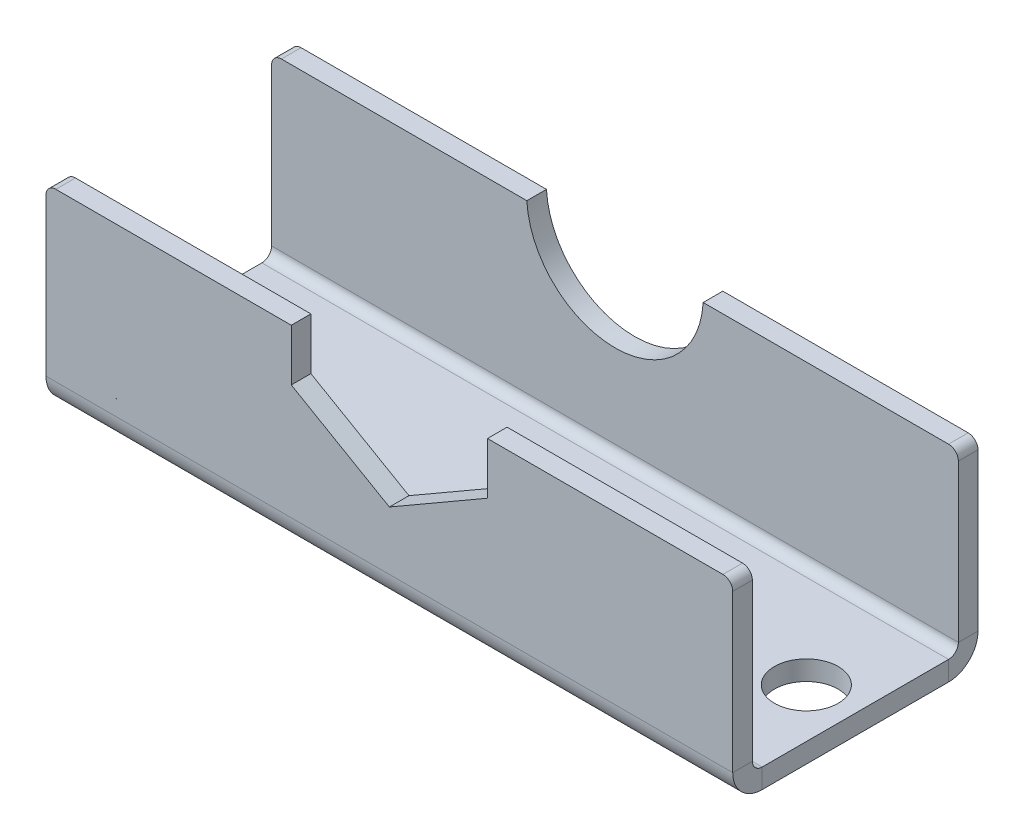
ISO-10303-21;
HEADER;
FILE_DESCRIPTION(('STEP AP214'),'2;1');
FILE_NAME('part.step','',(''),(''),'','','');
FILE_SCHEMA(('AUTOMOTIVE_DESIGN { 1 0 10303 214 1 1 1 1 }'));
ENDSEC;
DATA;
#1=APPLICATION_CONTEXT('core data for automotive mechanical design processes');
#2=APPLICATION_PROTOCOL_DEFINITION('international standard','automotive_design',2000,#1);
#3=PRODUCT_CONTEXT('',#1,'mechanical');
#4=PRODUCT('Part','Part','',(#3));
#5=PRODUCT_RELATED_PRODUCT_CATEGORY('part','',(#4));
#6=PRODUCT_DEFINITION_FORMATION('','',#4);
#7=PRODUCT_DEFINITION_CONTEXT('part definition',#1,'design');
#8=PRODUCT_DEFINITION('design','',#6,#7);
#9=PRODUCT_DEFINITION_SHAPE('','',#8);
#10=(LENGTH_UNIT() NAMED_UNIT(*) SI_UNIT(.MILLI.,.METRE.));
#11=(NAMED_UNIT(*) PLANE_ANGLE_UNIT() SI_UNIT($,.RADIAN.));
#12=(NAMED_UNIT(*) SI_UNIT($,.STERADIAN.) SOLID_ANGLE_UNIT());
#13=UNCERTAINTY_MEASURE_WITH_UNIT(LENGTH_MEASURE(1.E-05),#10,'distance_accuracy_value','');
#14=(GEOMETRIC_REPRESENTATION_CONTEXT(3) GLOBAL_UNCERTAINTY_ASSIGNED_CONTEXT((#13)) GLOBAL_UNIT_ASSIGNED_CONTEXT((#10,
#11,#12)) REPRESENTATION_CONTEXT('',''));
#15=CARTESIAN_POINT('',(0.,0.,0.));
#16=DIRECTION('',(0.,0.,1.));
#17=DIRECTION('',(1.,0.,0.));
#18=AXIS2_PLACEMENT_3D('',#15,#16,#17);
#19=CARTESIAN_POINT('',(70.,0.,-12.5));
#20=DIRECTION('',(0.,0.,-1.));
#21=DIRECTION('',(-1.,0.,0.));
#22=AXIS2_PLACEMENT_3D('',#19,#20,#21);
#23=PLANE('',#22);
#24=DIRECTION('',(0.,-1.,0.));
#25=VECTOR('',#24,1.);
#26=CARTESIAN_POINT('',(0.,0.,-12.5));
#27=LINE('',#26,#25);
#28=CARTESIAN_POINT('',(0.,19.,-12.5));
#29=VERTEX_POINT('',#28);
#30=CARTESIAN_POINT('',(0.,3.,-12.5));
#31=VERTEX_POINT('',#30);
#32=EDGE_CURVE('E380',#29,#31,#27,.T.);
#33=ORIENTED_EDGE('',*,*,#32,.F.);
#34=CARTESIAN_POINT('',(1.,19.,-12.5));
#35=DIRECTION('',(0.,0.,-1.));
#36=DIRECTION('',(-1.,0.,0.));
#37=AXIS2_PLACEMENT_3D('',#34,#35,#36);
#38=CIRCLE('',#37,1.);
#39=CARTESIAN_POINT('',(1.,20.,-12.5));
#40=VERTEX_POINT('',#39);
#41=EDGE_CURVE('E219',#29,#40,#38,.T.);
#42=ORIENTED_EDGE('',*,*,#41,.T.);
#43=DIRECTION('',(-1.,0.,0.));
#44=VECTOR('',#43,1.);
#45=CARTESIAN_POINT('',(70.,20.,-12.5));
#46=LINE('',#45,#44);
#47=CARTESIAN_POINT('',(26.0138996221943,20.,-12.5));
#48=VERTEX_POINT('',#47);
#49=EDGE_CURVE('E212',#48,#40,#46,.T.);
#50=ORIENTED_EDGE('',*,*,#49,.F.);
#51=CARTESIAN_POINT('',(35.,20.5,-12.5));
#52=DIRECTION('',(0.,0.,1.));
#53=DIRECTION('',(1.,0.,0.));
#54=AXIS2_PLACEMENT_3D('',#51,#52,#53);
#55=CIRCLE('',#54,9.);
#56=CARTESIAN_POINT('',(43.9861003778057,20.,-12.5));
#57=VERTEX_POINT('',#56);
#58=EDGE_CURVE('E195',#48,#57,#55,.T.);
#59=ORIENTED_EDGE('',*,*,#58,.T.);
#60=CARTESIAN_POINT('',(69.,20.,-12.5));
#61=VERTEX_POINT('',#60);
#62=EDGE_CURVE('E220',#61,#57,#46,.T.);
#63=ORIENTED_EDGE('',*,*,#62,.F.);
#64=CARTESIAN_POINT('',(69.,19.,-12.5));
#65=DIRECTION('',(0.,0.,-1.));
#66=DIRECTION('',(-1.,0.,0.));
#67=AXIS2_PLACEMENT_3D('',#64,#65,#66);
#68=CIRCLE('',#67,1.);
#69=CARTESIAN_POINT('',(70.,19.,-12.5));
#70=VERTEX_POINT('',#69);
#71=EDGE_CURVE('E265',#61,#70,#68,.T.);
#72=ORIENTED_EDGE('',*,*,#71,.T.);
#73=DIRECTION('',(0.,-1.,0.));
#74=VECTOR('',#73,1.);
#75=CARTESIAN_POINT('',(70.,0.,-12.5));
#76=LINE('',#75,#74);
#77=CARTESIAN_POINT('',(70.,3.,-12.5));
#78=VERTEX_POINT('',#77);
#79=EDGE_CURVE('E353',#70,#78,#76,.T.);
#80=ORIENTED_EDGE('',*,*,#79,.T.);
#81=DIRECTION('',(-1.,0.,0.));
#82=VECTOR('',#81,1.);
#83=CARTESIAN_POINT('',(70.,3.,-12.5));
#84=LINE('',#83,#82);
#85=EDGE_CURVE('E223',#78,#31,#84,.T.);
#86=ORIENTED_EDGE('',*,*,#85,.T.);
#87=EDGE_LOOP('',(#33,#42,#50,#59,#63,#72,#80,#86));
#88=FACE_BOUND('',#87,.T.);
#89=ADVANCED_FACE('F40',(#88),#23,.T.);
#90=CARTESIAN_POINT('',(70.,20.,-10.5));
#91=DIRECTION('',(0.,1.,0.));
#92=DIRECTION('',(0.,0.,1.));
#93=AXIS2_PLACEMENT_3D('',#90,#91,#92);
#94=PLANE('',#93);
#95=DIRECTION('',(-1.,0.,0.));
#96=VECTOR('',#95,1.);
#97=CARTESIAN_POINT('',(70.,20.,-10.5));
#98=LINE('',#97,#96);
#99=CARTESIAN_POINT('',(69.,20.,-10.5));
#100=VERTEX_POINT('',#99);
#101=CARTESIAN_POINT('',(43.9861003778057,20.,-10.5));
#102=VERTEX_POINT('',#101);
#103=EDGE_CURVE('E221',#100,#102,#98,.T.);
#104=ORIENTED_EDGE('',*,*,#103,.F.);
#105=DIRECTION('',(0.,0.,-1.));
#106=VECTOR('',#105,1.);
#107=CARTESIAN_POINT('',(69.,20.,-10.5));
#108=LINE('',#107,#106);
#109=EDGE_CURVE('E286',#100,#61,#108,.T.);
#110=ORIENTED_EDGE('',*,*,#109,.T.);
#111=ORIENTED_EDGE('',*,*,#62,.T.);
#112=DIRECTION('',(0.,0.,1.));
#113=VECTOR('',#112,1.);
#114=CARTESIAN_POINT('',(43.9861003778057,20.,-10.5));
#115=LINE('',#114,#113);
#116=EDGE_CURVE('E202',#102,#57,#115,.F.);
#117=ORIENTED_EDGE('',*,*,#116,.F.);
#118=EDGE_LOOP('',(#104,#110,#111,#117));
#119=FACE_BOUND('',#118,.T.);
#120=ADVANCED_FACE('F520',(#119),#94,.T.);
#121=ORIENTED_EDGE('',*,*,#49,.T.);
#122=DIRECTION('',(0.,0.,-1.));
#123=VECTOR('',#122,1.);
#124=CARTESIAN_POINT('',(1.,20.,-10.5));
#125=LINE('',#124,#123);
#126=CARTESIAN_POINT('',(1.,20.,-10.5));
#127=VERTEX_POINT('',#126);
#128=EDGE_CURVE('E268',#40,#127,#125,.F.);
#129=ORIENTED_EDGE('',*,*,#128,.T.);
#130=CARTESIAN_POINT('',(26.0138996221943,20.,-10.5));
#131=VERTEX_POINT('',#130);
#132=EDGE_CURVE('E215',#131,#127,#98,.T.);
#133=ORIENTED_EDGE('',*,*,#132,.F.);
#134=DIRECTION('',(0.,0.,1.));
#135=VECTOR('',#134,1.);
#136=CARTESIAN_POINT('',(26.0138996221943,20.,-10.5));
#137=LINE('',#136,#135);
#138=EDGE_CURVE('E199',#131,#48,#137,.F.);
#139=ORIENTED_EDGE('',*,*,#138,.T.);
#140=EDGE_LOOP('',(#121,#129,#133,#139));
#141=FACE_BOUND('',#140,.T.);
#142=ADVANCED_FACE('F211',(#141),#94,.T.);
#143=CARTESIAN_POINT('',(70.,0.,-10.5));
#144=DIRECTION('',(0.,0.,-1.));
#145=DIRECTION('',(-1.,0.,0.));
#146=AXIS2_PLACEMENT_3D('',#143,#144,#145);
#147=PLANE('',#146);
#148=ORIENTED_EDGE('',*,*,#132,.T.);
#149=CARTESIAN_POINT('',(1.,19.,-10.5));
#150=DIRECTION('',(0.,0.,-1.));
#151=DIRECTION('',(-1.,0.,0.));
#152=AXIS2_PLACEMENT_3D('',#149,#150,#151);
#153=CIRCLE('',#152,1.);
#154=CARTESIAN_POINT('',(0.,19.,-10.5));
#155=VERTEX_POINT('',#154);
#156=EDGE_CURVE('E272',#127,#155,#153,.F.);
#157=ORIENTED_EDGE('',*,*,#156,.T.);
#158=DIRECTION('',(0.,1.,0.));
#159=VECTOR('',#158,1.);
#160=CARTESIAN_POINT('',(0.,0.,-10.5));
#161=LINE('',#160,#159);
#162=CARTESIAN_POINT('',(0.,3.,-10.5));
#163=VERTEX_POINT('',#162);
#164=EDGE_CURVE('E382',#155,#163,#161,.F.);
#165=ORIENTED_EDGE('',*,*,#164,.T.);
#166=DIRECTION('',(-1.,0.,0.));
#167=VECTOR('',#166,1.);
#168=CARTESIAN_POINT('',(70.,3.,-10.5));
#169=LINE('',#168,#167);
#170=CARTESIAN_POINT('',(70.,3.,-10.5));
#171=VERTEX_POINT('',#170);
#172=EDGE_CURVE('E399',#171,#163,#169,.T.);
#173=ORIENTED_EDGE('',*,*,#172,.F.);
#174=DIRECTION('',(0.,1.,0.));
#175=VECTOR('',#174,1.);
#176=CARTESIAN_POINT('',(70.,0.,-10.5));
#177=LINE('',#176,#175);
#178=CARTESIAN_POINT('',(70.,19.,-10.5));
#179=VERTEX_POINT('',#178);
#180=EDGE_CURVE('E355',#179,#171,#177,.F.);
#181=ORIENTED_EDGE('',*,*,#180,.F.);
#182=CARTESIAN_POINT('',(69.,19.,-10.5));
#183=DIRECTION('',(0.,0.,-1.));
#184=DIRECTION('',(-1.,0.,0.));
#185=AXIS2_PLACEMENT_3D('',#182,#183,#184);
#186=CIRCLE('',#185,1.);
#187=EDGE_CURVE('E270',#179,#100,#186,.F.);
#188=ORIENTED_EDGE('',*,*,#187,.T.);
#189=ORIENTED_EDGE('',*,*,#103,.T.);
#190=CARTESIAN_POINT('',(35.,20.5,-10.5));
#191=DIRECTION('',(0.,0.,1.));
#192=DIRECTION('',(1.,0.,0.));
#193=AXIS2_PLACEMENT_3D('',#190,#191,#192);
#194=CIRCLE('',#193,9.);
#195=EDGE_CURVE('E206',#131,#102,#194,.T.);
#196=ORIENTED_EDGE('',*,*,#195,.F.);
#197=EDGE_LOOP('',(#148,#157,#165,#173,#181,#188,#189,#196));
#198=FACE_BOUND('',#197,.T.);
#199=ADVANCED_FACE('F407',(#198),#147,.F.);
#200=CARTESIAN_POINT('',(70.,20.,12.5));
#201=DIRECTION('',(0.,1.,0.));
#202=DIRECTION('',(0.,0.,1.));
#203=AXIS2_PLACEMENT_3D('',#200,#201,#202);
#204=PLANE('',#203);
#205=DIRECTION('',(-1.,0.,0.));
#206=VECTOR('',#205,1.);
#207=CARTESIAN_POINT('',(70.,20.,12.5));
#208=LINE('',#207,#206);
#209=CARTESIAN_POINT('',(69.,20.,12.5));
#210=VERTEX_POINT('',#209);
#211=CARTESIAN_POINT('',(45.,20.,12.5));
#212=VERTEX_POINT('',#211);
#213=EDGE_CURVE('E239',#210,#212,#208,.T.);
#214=ORIENTED_EDGE('',*,*,#213,.F.);
#215=DIRECTION('',(0.,0.,-1.));
#216=VECTOR('',#215,1.);
#217=CARTESIAN_POINT('',(69.,20.,12.5));
#218=LINE('',#217,#216);
#219=CARTESIAN_POINT('',(69.,20.,10.5));
#220=VERTEX_POINT('',#219);
#221=EDGE_CURVE('E48',#210,#220,#218,.T.);
#222=ORIENTED_EDGE('',*,*,#221,.T.);
#223=DIRECTION('',(-1.,0.,0.));
#224=VECTOR('',#223,1.);
#225=CARTESIAN_POINT('',(70.,20.,10.5));
#226=LINE('',#225,#224);
#227=CARTESIAN_POINT('',(45.,20.,10.5));
#228=VERTEX_POINT('',#227);
#229=EDGE_CURVE('E242',#220,#228,#226,.T.);
#230=ORIENTED_EDGE('',*,*,#229,.T.);
#231=DIRECTION('',(0.,0.,1.));
#232=VECTOR('',#231,1.);
#233=CARTESIAN_POINT('',(45.,20.,-12.501));
#234=LINE('',#233,#232);
#235=EDGE_CURVE('E216',#228,#212,#234,.T.);
#236=ORIENTED_EDGE('',*,*,#235,.T.);
#237=EDGE_LOOP('',(#214,#222,#230,#236));
#238=FACE_BOUND('',#237,.T.);
#239=ADVANCED_FACE('F294',(#238),#204,.T.);
#240=CARTESIAN_POINT('',(70.,0.,-9.5));
#241=DIRECTION('',(1.,0.,0.));
#242=DIRECTION('',(0.,0.,-1.));
#243=AXIS2_PLACEMENT_3D('',#240,#241,#242);
#244=PLANE('',#243);
#245=DIRECTION('',(0.,1.,0.));
#246=VECTOR('',#245,1.);
#247=CARTESIAN_POINT('',(70.,0.,-9.5));
#248=LINE('',#247,#246);
#249=CARTESIAN_POINT('',(70.,0.,-9.5));
#250=VERTEX_POINT('',#249);
#251=CARTESIAN_POINT('',(70.,2.,-9.5));
#252=VERTEX_POINT('',#251);
#253=EDGE_CURVE('E260',#250,#252,#248,.T.);
#254=ORIENTED_EDGE('',*,*,#253,.F.);
#255=CARTESIAN_POINT('',(70.,3.,-9.5));
#256=DIRECTION('',(1.,0.,0.));
#257=DIRECTION('',(0.,0.,-1.));
#258=AXIS2_PLACEMENT_3D('',#255,#256,#257);
#259=CIRCLE('',#258,3.);
#260=EDGE_CURVE('E350',#78,#250,#259,.F.);
#261=ORIENTED_EDGE('',*,*,#260,.F.);
#262=DIRECTION('',(0.,0.,-1.));
#263=VECTOR('',#262,1.);
#264=CARTESIAN_POINT('',(70.,3.,-10.5));
#265=LINE('',#264,#263);
#266=EDGE_CURVE('E257',#171,#78,#265,.T.);
#267=ORIENTED_EDGE('',*,*,#266,.F.);
#268=CARTESIAN_POINT('',(70.,3.,-9.5));
#269=DIRECTION('',(1.,0.,0.));
#270=DIRECTION('',(0.,0.,-1.));
#271=AXIS2_PLACEMENT_3D('',#268,#269,#270);
#272=CIRCLE('',#271,1.);
#273=EDGE_CURVE('E357',#171,#252,#272,.F.);
#274=ORIENTED_EDGE('',*,*,#273,.T.);
#275=EDGE_LOOP('',(#254,#261,#267,#274));
#276=FACE_BOUND('',#275,.T.);
#277=ADVANCED_FACE('F557',(#276),#244,.T.);
#278=CARTESIAN_POINT('',(70.,3.,-10.5));
#279=DIRECTION('',(1.,0.,0.));
#280=DIRECTION('',(0.,0.,-1.));
#281=AXIS2_PLACEMENT_3D('',#278,#279,#280);
#282=PLANE('',#281);
#283=DIRECTION('',(0.,0.,1.));
#284=VECTOR('',#283,1.);
#285=CARTESIAN_POINT('',(70.,0.,12.5));
#286=LINE('',#285,#284);
#287=CARTESIAN_POINT('',(70.,0.,9.5));
#288=VERTEX_POINT('',#287);
#289=EDGE_CURVE('E347',#250,#288,#286,.T.);
#290=ORIENTED_EDGE('',*,*,#289,.F.);
#291=ORIENTED_EDGE('',*,*,#253,.T.);
#292=DIRECTION('',(0.,0.,1.));
#293=VECTOR('',#292,1.);
#294=CARTESIAN_POINT('',(70.,2.,12.5));
#295=LINE('',#294,#293);
#296=CARTESIAN_POINT('',(70.,2.,9.5));
#297=VERTEX_POINT('',#296);
#298=EDGE_CURVE('E360',#252,#297,#295,.T.);
#299=ORIENTED_EDGE('',*,*,#298,.T.);
#300=DIRECTION('',(0.,-1.,0.));
#301=VECTOR('',#300,1.);
#302=CARTESIAN_POINT('',(70.,2.,9.5));
#303=LINE('',#302,#301);
#304=EDGE_CURVE('E248',#297,#288,#303,.T.);
#305=ORIENTED_EDGE('',*,*,#304,.T.);
#306=EDGE_LOOP('',(#290,#291,#299,#305));
#307=FACE_BOUND('',#306,.T.);
#308=ADVANCED_FACE('F554',(#307),#282,.T.);
#309=CARTESIAN_POINT('',(0.,3.,-12.5));
#310=DIRECTION('',(-1.,0.,0.));
#311=DIRECTION('',(0.,0.,1.));
#312=AXIS2_PLACEMENT_3D('',#309,#310,#311);
#313=PLANE('',#312);
#314=DIRECTION('',(0.,0.,1.));
#315=VECTOR('',#314,1.);
#316=CARTESIAN_POINT('',(0.,3.,-12.5));
#317=LINE('',#316,#315);
#318=EDGE_CURVE('E254',#31,#163,#317,.T.);
#319=ORIENTED_EDGE('',*,*,#318,.F.);
#320=CARTESIAN_POINT('',(0.,3.,-9.5));
#321=DIRECTION('',(1.,0.,0.));
#322=DIRECTION('',(0.,0.,-1.));
#323=AXIS2_PLACEMENT_3D('',#320,#321,#322);
#324=CIRCLE('',#323,3.);
#325=CARTESIAN_POINT('',(0.,0.,-9.5));
#326=VERTEX_POINT('',#325);
#327=EDGE_CURVE('E377',#31,#326,#324,.F.);
#328=ORIENTED_EDGE('',*,*,#327,.T.);
#329=DIRECTION('',(0.,-1.,0.));
#330=VECTOR('',#329,1.);
#331=CARTESIAN_POINT('',(0.,2.,-9.5));
#332=LINE('',#331,#330);
#333=CARTESIAN_POINT('',(0.,2.,-9.5));
#334=VERTEX_POINT('',#333);
#335=EDGE_CURVE('E252',#334,#326,#332,.T.);
#336=ORIENTED_EDGE('',*,*,#335,.F.);
#337=CARTESIAN_POINT('',(0.,3.,-9.5));
#338=DIRECTION('',(1.,0.,0.));
#339=DIRECTION('',(0.,0.,-1.));
#340=AXIS2_PLACEMENT_3D('',#337,#338,#339);
#341=CIRCLE('',#340,1.);
#342=EDGE_CURVE('E384',#163,#334,#341,.F.);
#343=ORIENTED_EDGE('',*,*,#342,.F.);
#344=EDGE_LOOP('',(#319,#328,#336,#343));
#345=FACE_BOUND('',#344,.T.);
#346=ADVANCED_FACE('F424',(#345),#313,.T.);
#347=CARTESIAN_POINT('',(0.,2.,-9.5));
#348=DIRECTION('',(-1.,0.,0.));
#349=DIRECTION('',(0.,0.,1.));
#350=AXIS2_PLACEMENT_3D('',#347,#348,#349);
#351=PLANE('',#350);
#352=ORIENTED_EDGE('',*,*,#164,.F.);
#353=DIRECTION('',(0.,0.,-1.));
#354=VECTOR('',#353,1.);
#355=CARTESIAN_POINT('',(0.,19.,-9.5));
#356=LINE('',#355,#354);
#357=EDGE_CURVE('E262',#155,#29,#356,.T.);
#358=ORIENTED_EDGE('',*,*,#357,.T.);
#359=ORIENTED_EDGE('',*,*,#32,.T.);
#360=ORIENTED_EDGE('',*,*,#318,.T.);
#361=EDGE_LOOP('',(#352,#358,#359,#360));
#362=FACE_BOUND('',#361,.T.);
#363=ADVANCED_FACE('F413',(#362),#351,.T.);
#364=CARTESIAN_POINT('',(70.,3.,12.5));
#365=DIRECTION('',(1.,0.,0.));
#366=DIRECTION('',(0.,0.,-1.));
#367=AXIS2_PLACEMENT_3D('',#364,#365,#366);
#368=PLANE('',#367);
#369=DIRECTION('',(0.,0.,-1.));
#370=VECTOR('',#369,1.);
#371=CARTESIAN_POINT('',(70.,3.,12.5));
#372=LINE('',#371,#370);
#373=CARTESIAN_POINT('',(70.,3.,12.5));
#374=VERTEX_POINT('',#373);
#375=CARTESIAN_POINT('',(70.,3.,10.5));
#376=VERTEX_POINT('',#375);
#377=EDGE_CURVE('E250',#374,#376,#372,.T.);
#378=ORIENTED_EDGE('',*,*,#377,.F.);
#379=CARTESIAN_POINT('',(70.,3.,9.5));
#380=DIRECTION('',(1.,0.,0.));
#381=DIRECTION('',(0.,0.,-1.));
#382=AXIS2_PLACEMENT_3D('',#379,#380,#381);
#383=CIRCLE('',#382,3.);
#384=EDGE_CURVE('E344',#288,#374,#383,.F.);
#385=ORIENTED_EDGE('',*,*,#384,.F.);
#386=ORIENTED_EDGE('',*,*,#304,.F.);
#387=CARTESIAN_POINT('',(70.,3.,9.5));
#388=DIRECTION('',(1.,0.,0.));
#389=DIRECTION('',(0.,0.,-1.));
#390=AXIS2_PLACEMENT_3D('',#387,#388,#389);
#391=CIRCLE('',#390,1.);
#392=EDGE_CURVE('E363',#297,#376,#391,.F.);
#393=ORIENTED_EDGE('',*,*,#392,.T.);
#394=EDGE_LOOP('',(#378,#385,#386,#393));
#395=FACE_BOUND('',#394,.T.);
#396=ADVANCED_FACE('F546',(#395),#368,.T.);
#397=CARTESIAN_POINT('',(70.,2.,9.5));
#398=DIRECTION('',(1.,0.,0.));
#399=DIRECTION('',(0.,0.,-1.));
#400=AXIS2_PLACEMENT_3D('',#397,#398,#399);
#401=PLANE('',#400);
#402=DIRECTION('',(0.,1.,0.));
#403=VECTOR('',#402,1.);
#404=CARTESIAN_POINT('',(70.,0.,10.5));
#405=LINE('',#404,#403);
#406=CARTESIAN_POINT('',(70.,19.,10.5));
#407=VERTEX_POINT('',#406);
#408=EDGE_CURVE('E339',#376,#407,#405,.T.);
#409=ORIENTED_EDGE('',*,*,#408,.T.);
#410=DIRECTION('',(0.,0.,-1.));
#411=VECTOR('',#410,1.);
#412=CARTESIAN_POINT('',(70.,19.,9.5));
#413=LINE('',#412,#411);
#414=CARTESIAN_POINT('',(70.,19.,12.5));
#415=VERTEX_POINT('',#414);
#416=EDGE_CURVE('E11',#407,#415,#413,.F.);
#417=ORIENTED_EDGE('',*,*,#416,.T.);
#418=DIRECTION('',(0.,1.,0.));
#419=VECTOR('',#418,1.);
#420=CARTESIAN_POINT('',(70.,0.,12.5));
#421=LINE('',#420,#419);
#422=EDGE_CURVE('E341',#374,#415,#421,.T.);
#423=ORIENTED_EDGE('',*,*,#422,.F.);
#424=ORIENTED_EDGE('',*,*,#377,.T.);
#425=EDGE_LOOP('',(#409,#417,#423,#424));
#426=FACE_BOUND('',#425,.T.);
#427=ADVANCED_FACE('F543',(#426),#401,.T.);
#428=CARTESIAN_POINT('',(0.,0.,9.5));
#429=DIRECTION('',(-1.,0.,0.));
#430=DIRECTION('',(0.,0.,1.));
#431=AXIS2_PLACEMENT_3D('',#428,#429,#430);
#432=PLANE('',#431);
#433=DIRECTION('',(0.,1.,0.));
#434=VECTOR('',#433,1.);
#435=CARTESIAN_POINT('',(0.,0.,9.5));
#436=LINE('',#435,#434);
#437=CARTESIAN_POINT('',(0.,0.,9.5));
#438=VERTEX_POINT('',#437);
#439=CARTESIAN_POINT('',(0.,2.,9.5));
#440=VERTEX_POINT('',#439);
#441=EDGE_CURVE('E246',#438,#440,#436,.T.);
#442=ORIENTED_EDGE('',*,*,#441,.F.);
#443=CARTESIAN_POINT('',(0.,3.,9.5));
#444=DIRECTION('',(1.,0.,0.));
#445=DIRECTION('',(0.,0.,-1.));
#446=AXIS2_PLACEMENT_3D('',#443,#444,#445);
#447=CIRCLE('',#446,3.);
#448=CARTESIAN_POINT('',(0.,3.,12.5));
#449=VERTEX_POINT('',#448);
#450=EDGE_CURVE('E371',#438,#449,#447,.F.);
#451=ORIENTED_EDGE('',*,*,#450,.T.);
#452=DIRECTION('',(0.,0.,1.));
#453=VECTOR('',#452,1.);
#454=CARTESIAN_POINT('',(0.,3.,10.5));
#455=LINE('',#454,#453);
#456=CARTESIAN_POINT('',(0.,3.,10.5));
#457=VERTEX_POINT('',#456);
#458=EDGE_CURVE('E244',#457,#449,#455,.T.);
#459=ORIENTED_EDGE('',*,*,#458,.F.);
#460=CARTESIAN_POINT('',(0.,3.,9.5));
#461=DIRECTION('',(1.,0.,0.));
#462=DIRECTION('',(0.,0.,-1.));
#463=AXIS2_PLACEMENT_3D('',#460,#461,#462);
#464=CIRCLE('',#463,1.);
#465=EDGE_CURVE('E342',#440,#457,#464,.F.);
#466=ORIENTED_EDGE('',*,*,#465,.F.);
#467=EDGE_LOOP('',(#442,#451,#459,#466));
#468=FACE_BOUND('',#467,.T.);
#469=ADVANCED_FACE('F436',(#468),#432,.T.);
#470=CARTESIAN_POINT('',(0.,3.,10.5));
#471=DIRECTION('',(-1.,0.,0.));
#472=DIRECTION('',(0.,0.,1.));
#473=AXIS2_PLACEMENT_3D('',#470,#471,#472);
#474=PLANE('',#473);
#475=DIRECTION('',(0.,0.,1.));
#476=VECTOR('',#475,1.);
#477=CARTESIAN_POINT('',(0.,0.,12.5));
#478=LINE('',#477,#476);
#479=EDGE_CURVE('E374',#326,#438,#478,.T.);
#480=ORIENTED_EDGE('',*,*,#479,.T.);
#481=ORIENTED_EDGE('',*,*,#441,.T.);
#482=DIRECTION('',(0.,0.,1.));
#483=VECTOR('',#482,1.);
#484=CARTESIAN_POINT('',(0.,2.,12.5));
#485=LINE('',#484,#483);
#486=EDGE_CURVE('E387',#334,#440,#485,.T.);
#487=ORIENTED_EDGE('',*,*,#486,.F.);
#488=ORIENTED_EDGE('',*,*,#335,.T.);
#489=EDGE_LOOP('',(#480,#481,#487,#488));
#490=FACE_BOUND('',#489,.T.);
#491=ADVANCED_FACE('F433',(#490),#474,.T.);
#492=CARTESIAN_POINT('',(70.,0.,10.5));
#493=DIRECTION('',(0.,0.,1.));
#494=DIRECTION('',(0.,-1.,0.));
#495=AXIS2_PLACEMENT_3D('',#492,#493,#494);
#496=PLANE('',#495);
#497=DIRECTION('',(0.,1.,0.));
#498=VECTOR('',#497,1.);
#499=CARTESIAN_POINT('',(0.,0.,10.5));
#500=LINE('',#499,#498);
#501=CARTESIAN_POINT('',(0.,19.,10.5));
#502=VERTEX_POINT('',#501);
#503=EDGE_CURVE('E338',#457,#502,#500,.T.);
#504=ORIENTED_EDGE('',*,*,#503,.T.);
#505=CARTESIAN_POINT('',(1.,19.,10.5));
#506=DIRECTION('',(0.,0.,1.));
#507=DIRECTION('',(0.,-1.,0.));
#508=AXIS2_PLACEMENT_3D('',#505,#506,#507);
#509=CIRCLE('',#508,1.);
#510=CARTESIAN_POINT('',(1.,20.,10.5));
#511=VERTEX_POINT('',#510);
#512=EDGE_CURVE('E279',#502,#511,#509,.F.);
#513=ORIENTED_EDGE('',*,*,#512,.T.);
#514=CARTESIAN_POINT('',(25.,20.,10.5));
#515=VERTEX_POINT('',#514);
#516=EDGE_CURVE('E241',#515,#511,#226,.T.);
#517=ORIENTED_EDGE('',*,*,#516,.F.);
#518=DIRECTION('',(0.,1.,0.));
#519=VECTOR('',#518,1.);
#520=CARTESIAN_POINT('',(25.,26.2735026918962,10.5));
#521=LINE('',#520,#519);
#522=CARTESIAN_POINT('',(25.,14.7264973081038,10.5));
#523=VERTEX_POINT('',#522);
#524=EDGE_CURVE('E312',#523,#515,#521,.T.);
#525=ORIENTED_EDGE('',*,*,#524,.F.);
#526=DIRECTION('',(-0.866025403784439,0.5,0.));
#527=VECTOR('',#526,1.);
#528=CARTESIAN_POINT('',(25.,14.7264973081037,10.5));
#529=LINE('',#528,#527);
#530=CARTESIAN_POINT('',(35.,8.95299461620749,10.5));
#531=VERTEX_POINT('',#530);
#532=EDGE_CURVE('E309',#531,#523,#529,.T.);
#533=ORIENTED_EDGE('',*,*,#532,.F.);
#534=DIRECTION('',(-0.866025403784438,-0.500000000000001,0.));
#535=VECTOR('',#534,1.);
#536=CARTESIAN_POINT('',(35.,8.95299461620749,10.5));
#537=LINE('',#536,#535);
#538=CARTESIAN_POINT('',(45.,14.7264973081038,10.5));
#539=VERTEX_POINT('',#538);
#540=EDGE_CURVE('E306',#539,#531,#537,.T.);
#541=ORIENTED_EDGE('',*,*,#540,.F.);
#542=DIRECTION('',(0.,-1.,0.));
#543=VECTOR('',#542,1.);
#544=CARTESIAN_POINT('',(45.,14.7264973081037,10.5));
#545=LINE('',#544,#543);
#546=EDGE_CURVE('E304',#228,#539,#545,.T.);
#547=ORIENTED_EDGE('',*,*,#546,.F.);
#548=ORIENTED_EDGE('',*,*,#229,.F.);
#549=CARTESIAN_POINT('',(69.,19.,10.5));
#550=DIRECTION('',(0.,0.,1.));
#551=DIRECTION('',(0.,-1.,0.));
#552=AXIS2_PLACEMENT_3D('',#549,#550,#551);
#553=CIRCLE('',#552,1.);
#554=EDGE_CURVE('E277',#220,#407,#553,.F.);
#555=ORIENTED_EDGE('',*,*,#554,.T.);
#556=ORIENTED_EDGE('',*,*,#408,.F.);
#557=DIRECTION('',(-1.,0.,0.));
#558=VECTOR('',#557,1.);
#559=CARTESIAN_POINT('',(70.,3.,10.5));
#560=LINE('',#559,#558);
#561=EDGE_CURVE('E366',#376,#457,#560,.T.);
#562=ORIENTED_EDGE('',*,*,#561,.T.);
#563=EDGE_LOOP('',(#504,#513,#517,#525,#533,#541,#547,#548,#555,#556,#562));
#564=FACE_BOUND('',#563,.T.);
#565=ADVANCED_FACE('F301',(#564),#496,.F.);
#566=ORIENTED_EDGE('',*,*,#516,.T.);
#567=DIRECTION('',(0.,0.,-1.));
#568=VECTOR('',#567,1.);
#569=CARTESIAN_POINT('',(1.,20.,12.5));
#570=LINE('',#569,#568);
#571=CARTESIAN_POINT('',(1.,20.,12.5));
#572=VERTEX_POINT('',#571);
#573=EDGE_CURVE('E281',#511,#572,#570,.F.);
#574=ORIENTED_EDGE('',*,*,#573,.T.);
#575=CARTESIAN_POINT('',(25.,20.,12.5));
#576=VERTEX_POINT('',#575);
#577=EDGE_CURVE('E238',#576,#572,#208,.T.);
#578=ORIENTED_EDGE('',*,*,#577,.F.);
#579=DIRECTION('',(0.,0.,-1.));
#580=VECTOR('',#579,1.);
#581=CARTESIAN_POINT('',(25.,20.,-12.501));
#582=LINE('',#581,#580);
#583=EDGE_CURVE('E310',#576,#515,#582,.T.);
#584=ORIENTED_EDGE('',*,*,#583,.T.);
#585=EDGE_LOOP('',(#566,#574,#578,#584));
#586=FACE_BOUND('',#585,.T.);
#587=ADVANCED_FACE('F461',(#586),#204,.T.);
#588=CARTESIAN_POINT('',(70.,0.,12.5));
#589=DIRECTION('',(0.,0.,1.));
#590=DIRECTION('',(0.,-1.,0.));
#591=AXIS2_PLACEMENT_3D('',#588,#589,#590);
#592=PLANE('',#591);
#593=ORIENTED_EDGE('',*,*,#577,.T.);
#594=CARTESIAN_POINT('',(1.,19.,12.5));
#595=DIRECTION('',(0.,0.,1.));
#596=DIRECTION('',(0.,-1.,0.));
#597=AXIS2_PLACEMENT_3D('',#594,#595,#596);
#598=CIRCLE('',#597,1.);
#599=CARTESIAN_POINT('',(0.,19.,12.5));
#600=VERTEX_POINT('',#599);
#601=EDGE_CURVE('E284',#572,#600,#598,.T.);
#602=ORIENTED_EDGE('',*,*,#601,.T.);
#603=DIRECTION('',(0.,1.,0.));
#604=VECTOR('',#603,1.);
#605=CARTESIAN_POINT('',(0.,0.,12.5));
#606=LINE('',#605,#604);
#607=EDGE_CURVE('E368',#449,#600,#606,.T.);
#608=ORIENTED_EDGE('',*,*,#607,.F.);
#609=DIRECTION('',(-1.,0.,0.));
#610=VECTOR('',#609,1.);
#611=CARTESIAN_POINT('',(70.,3.,12.5));
#612=LINE('',#611,#610);
#613=EDGE_CURVE('E235',#374,#449,#612,.T.);
#614=ORIENTED_EDGE('',*,*,#613,.F.);
#615=ORIENTED_EDGE('',*,*,#422,.T.);
#616=CARTESIAN_POINT('',(69.,19.,12.5));
#617=DIRECTION('',(0.,0.,1.));
#618=DIRECTION('',(0.,-1.,0.));
#619=AXIS2_PLACEMENT_3D('',#616,#617,#618);
#620=CIRCLE('',#619,1.);
#621=EDGE_CURVE('E55',#415,#210,#620,.T.);
#622=ORIENTED_EDGE('',*,*,#621,.T.);
#623=ORIENTED_EDGE('',*,*,#213,.T.);
#624=DIRECTION('',(0.,1.,0.));
#625=VECTOR('',#624,1.);
#626=CARTESIAN_POINT('',(45.,14.7264973081038,12.5));
#627=LINE('',#626,#625);
#628=CARTESIAN_POINT('',(45.,14.7264973081038,12.5));
#629=VERTEX_POINT('',#628);
#630=EDGE_CURVE('E325',#629,#212,#627,.T.);
#631=ORIENTED_EDGE('',*,*,#630,.F.);
#632=DIRECTION('',(0.866025403784438,0.500000000000001,0.));
#633=VECTOR('',#632,1.);
#634=CARTESIAN_POINT('',(35.,8.95299461620749,12.5));
#635=LINE('',#634,#633);
#636=CARTESIAN_POINT('',(35.,8.95299461620749,12.5));
#637=VERTEX_POINT('',#636);
#638=EDGE_CURVE('E322',#637,#629,#635,.T.);
#639=ORIENTED_EDGE('',*,*,#638,.F.);
#640=DIRECTION('',(0.866025403784439,-0.5,0.));
#641=VECTOR('',#640,1.);
#642=CARTESIAN_POINT('',(25.,14.7264973081037,12.5));
#643=LINE('',#642,#641);
#644=CARTESIAN_POINT('',(25.,14.7264973081038,12.5));
#645=VERTEX_POINT('',#644);
#646=EDGE_CURVE('E319',#645,#637,#643,.T.);
#647=ORIENTED_EDGE('',*,*,#646,.F.);
#648=DIRECTION('',(0.,-1.,0.));
#649=VECTOR('',#648,1.);
#650=CARTESIAN_POINT('',(25.,26.2735026918963,12.5));
#651=LINE('',#650,#649);
#652=EDGE_CURVE('E328',#576,#645,#651,.T.);
#653=ORIENTED_EDGE('',*,*,#652,.F.);
#654=EDGE_LOOP('',(#593,#602,#608,#614,#615,#622,#623,#631,#639,#647,#653));
#655=FACE_BOUND('',#654,.T.);
#656=ADVANCED_FACE('F448',(#655),#592,.T.);
#657=CARTESIAN_POINT('',(70.,3.,9.5));
#658=DIRECTION('',(-1.,0.,0.));
#659=DIRECTION('',(0.,0.,1.));
#660=AXIS2_PLACEMENT_3D('',#657,#658,#659);
#661=CYLINDRICAL_SURFACE('',#660,3.);
#662=ORIENTED_EDGE('',*,*,#450,.F.);
#663=DIRECTION('',(-1.,0.,0.));
#664=VECTOR('',#663,1.);
#665=CARTESIAN_POINT('',(70.,0.,9.5));
#666=LINE('',#665,#664);
#667=EDGE_CURVE('E232',#288,#438,#666,.T.);
#668=ORIENTED_EDGE('',*,*,#667,.F.);
#669=ORIENTED_EDGE('',*,*,#384,.T.);
#670=ORIENTED_EDGE('',*,*,#613,.T.);
#671=EDGE_LOOP('',(#662,#668,#669,#670));
#672=FACE_BOUND('',#671,.T.);
#673=ADVANCED_FACE('F444',(#672),#661,.T.);
#674=CARTESIAN_POINT('',(70.,0.,12.5));
#675=DIRECTION('',(0.,-1.,0.));
#676=DIRECTION('',(0.,0.,-1.));
#677=AXIS2_PLACEMENT_3D('',#674,#675,#676);
#678=PLANE('',#677);
#679=CARTESIAN_POINT('',(65.,0.,0.));
#680=DIRECTION('',(0.,-1.,0.));
#681=DIRECTION('',(0.,0.,-1.));
#682=AXIS2_PLACEMENT_3D('',#679,#680,#681);
#683=CIRCLE('',#682,3.25000000000001);
#684=CARTESIAN_POINT('',(65.,0.,-3.25000000000001));
#685=VERTEX_POINT('',#684);
#686=EDGE_CURVE('E483',#685,#685,#683,.T.);
#687=ORIENTED_EDGE('',*,*,#686,.F.);
#688=EDGE_LOOP('',(#687));
#689=FACE_BOUND('',#688,.T.);
#690=CARTESIAN_POINT('',(5.,0.,0.));
#691=DIRECTION('',(0.,-1.,0.));
#692=DIRECTION('',(0.,0.,1.));
#693=AXIS2_PLACEMENT_3D('',#690,#691,#692);
#694=CIRCLE('',#693,3.25000000000001);
#695=CARTESIAN_POINT('',(5.,0.,3.25000000000001));
#696=VERTEX_POINT('',#695);
#697=EDGE_CURVE('E484',#696,#696,#694,.T.);
#698=ORIENTED_EDGE('',*,*,#697,.F.);
#699=EDGE_LOOP('',(#698));
#700=FACE_BOUND('',#699,.T.);
#701=ORIENTED_EDGE('',*,*,#479,.F.);
#702=DIRECTION('',(-1.,0.,0.));
#703=VECTOR('',#702,1.);
#704=CARTESIAN_POINT('',(70.,0.,-9.5));
#705=LINE('',#704,#703);
#706=EDGE_CURVE('E229',#250,#326,#705,.T.);
#707=ORIENTED_EDGE('',*,*,#706,.F.);
#708=ORIENTED_EDGE('',*,*,#289,.T.);
#709=ORIENTED_EDGE('',*,*,#667,.T.);
#710=EDGE_LOOP('',(#701,#707,#708,#709));
#711=FACE_BOUND('',#710,.T.);
#712=ADVANCED_FACE('F440',(#689,#700,#711),#678,.T.);
#713=CARTESIAN_POINT('',(70.,3.,-9.5));
#714=DIRECTION('',(-1.,0.,0.));
#715=DIRECTION('',(0.,0.,1.));
#716=AXIS2_PLACEMENT_3D('',#713,#714,#715);
#717=CYLINDRICAL_SURFACE('',#716,3.);
#718=ORIENTED_EDGE('',*,*,#327,.F.);
#719=ORIENTED_EDGE('',*,*,#85,.F.);
#720=ORIENTED_EDGE('',*,*,#260,.T.);
#721=ORIENTED_EDGE('',*,*,#706,.T.);
#722=EDGE_LOOP('',(#718,#719,#720,#721));
#723=FACE_BOUND('',#722,.T.);
#724=ADVANCED_FACE('F420',(#723),#717,.T.);
#725=CARTESIAN_POINT('',(70.,3.,-9.5));
#726=DIRECTION('',(-1.,0.,0.));
#727=DIRECTION('',(0.,0.,1.));
#728=AXIS2_PLACEMENT_3D('',#725,#726,#727);
#729=CYLINDRICAL_SURFACE('',#728,1.);
#730=ORIENTED_EDGE('',*,*,#342,.T.);
#731=DIRECTION('',(-1.,0.,0.));
#732=VECTOR('',#731,1.);
#733=CARTESIAN_POINT('',(70.,2.,-9.5));
#734=LINE('',#733,#732);
#735=EDGE_CURVE('E397',#252,#334,#734,.T.);
#736=ORIENTED_EDGE('',*,*,#735,.F.);
#737=ORIENTED_EDGE('',*,*,#273,.F.);
#738=ORIENTED_EDGE('',*,*,#172,.T.);
#739=EDGE_LOOP('',(#730,#736,#737,#738));
#740=FACE_BOUND('',#739,.T.);
#741=ADVANCED_FACE('F426',(#740),#729,.F.);
#742=CARTESIAN_POINT('',(70.,2.,12.5));
#743=DIRECTION('',(0.,-1.,0.));
#744=DIRECTION('',(0.,0.,-1.));
#745=AXIS2_PLACEMENT_3D('',#742,#743,#744);
#746=PLANE('',#745);
#747=CARTESIAN_POINT('',(65.,2.,0.));
#748=DIRECTION('',(0.,-1.,0.));
#749=DIRECTION('',(0.,0.,-1.));
#750=AXIS2_PLACEMENT_3D('',#747,#748,#749);
#751=CIRCLE('',#750,3.25000000000001);
#752=CARTESIAN_POINT('',(65.,2.,-3.25000000000001));
#753=VERTEX_POINT('',#752);
#754=EDGE_CURVE('E478',#753,#753,#751,.F.);
#755=ORIENTED_EDGE('',*,*,#754,.F.);
#756=EDGE_LOOP('',(#755));
#757=FACE_BOUND('',#756,.T.);
#758=CARTESIAN_POINT('',(5.,2.,0.));
#759=DIRECTION('',(0.,-1.,0.));
#760=DIRECTION('',(0.,0.,-1.));
#761=AXIS2_PLACEMENT_3D('',#758,#759,#760);
#762=CIRCLE('',#761,3.25000000000001);
#763=CARTESIAN_POINT('',(5.,2.,-3.25000000000001));
#764=VERTEX_POINT('',#763);
#765=EDGE_CURVE('E480',#764,#764,#762,.F.);
#766=ORIENTED_EDGE('',*,*,#765,.F.);
#767=EDGE_LOOP('',(#766));
#768=FACE_BOUND('',#767,.T.);
#769=ORIENTED_EDGE('',*,*,#486,.T.);
#770=DIRECTION('',(-1.,0.,0.));
#771=VECTOR('',#770,1.);
#772=CARTESIAN_POINT('',(70.,2.,9.5));
#773=LINE('',#772,#771);
#774=EDGE_CURVE('E394',#297,#440,#773,.T.);
#775=ORIENTED_EDGE('',*,*,#774,.F.);
#776=ORIENTED_EDGE('',*,*,#298,.F.);
#777=ORIENTED_EDGE('',*,*,#735,.T.);
#778=EDGE_LOOP('',(#769,#775,#776,#777));
#779=FACE_BOUND('',#778,.T.);
#780=ADVANCED_FACE('F430',(#757,#768,#779),#746,.F.);
#781=CARTESIAN_POINT('',(70.,3.,9.5));
#782=DIRECTION('',(-1.,0.,0.));
#783=DIRECTION('',(0.,0.,1.));
#784=AXIS2_PLACEMENT_3D('',#781,#782,#783);
#785=CYLINDRICAL_SURFACE('',#784,1.);
#786=ORIENTED_EDGE('',*,*,#465,.T.);
#787=ORIENTED_EDGE('',*,*,#561,.F.);
#788=ORIENTED_EDGE('',*,*,#392,.F.);
#789=ORIENTED_EDGE('',*,*,#774,.T.);
#790=EDGE_LOOP('',(#786,#787,#788,#789));
#791=FACE_BOUND('',#790,.T.);
#792=ADVANCED_FACE('F507',(#791),#785,.F.);
#793=CARTESIAN_POINT('',(70.,3.,9.5));
#794=DIRECTION('',(1.,0.,0.));
#795=DIRECTION('',(0.,0.,-1.));
#796=AXIS2_PLACEMENT_3D('',#793,#794,#795);
#797=PLANE('',#796);
#798=ORIENTED_EDGE('',*,*,#79,.F.);
#799=DIRECTION('',(0.,0.,-1.));
#800=VECTOR('',#799,1.);
#801=CARTESIAN_POINT('',(70.,19.,9.5));
#802=LINE('',#801,#800);
#803=EDGE_CURVE('E289',#70,#179,#802,.F.);
#804=ORIENTED_EDGE('',*,*,#803,.T.);
#805=ORIENTED_EDGE('',*,*,#180,.T.);
#806=ORIENTED_EDGE('',*,*,#266,.T.);
#807=EDGE_LOOP('',(#798,#804,#805,#806));
#808=FACE_BOUND('',#807,.T.);
#809=ADVANCED_FACE('F514',(#808),#797,.T.);
#810=CARTESIAN_POINT('',(0.,3.,9.5));
#811=DIRECTION('',(1.,0.,0.));
#812=DIRECTION('',(0.,0.,-1.));
#813=AXIS2_PLACEMENT_3D('',#810,#811,#812);
#814=PLANE('',#813);
#815=ORIENTED_EDGE('',*,*,#607,.T.);
#816=DIRECTION('',(0.,0.,-1.));
#817=VECTOR('',#816,1.);
#818=CARTESIAN_POINT('',(0.,19.,10.5));
#819=LINE('',#818,#817);
#820=EDGE_CURVE('E274',#600,#502,#819,.T.);
#821=ORIENTED_EDGE('',*,*,#820,.T.);
#822=ORIENTED_EDGE('',*,*,#503,.F.);
#823=ORIENTED_EDGE('',*,*,#458,.T.);
#824=EDGE_LOOP('',(#815,#821,#822,#823));
#825=FACE_BOUND('',#824,.T.);
#826=ADVANCED_FACE('F452',(#825),#814,.F.);
#827=CARTESIAN_POINT('',(35.,8.95299461620749,-12.501));
#828=DIRECTION('',(0.500000000000001,-0.866025403784438,0.));
#829=DIRECTION('',(0.866025403784438,0.500000000000001,0.));
#830=AXIS2_PLACEMENT_3D('',#827,#828,#829);
#831=PLANE('',#830);
#832=ORIENTED_EDGE('',*,*,#540,.T.);
#833=DIRECTION('',(0.,0.,1.));
#834=VECTOR('',#833,1.);
#835=CARTESIAN_POINT('',(35.,8.95299461620749,-12.501));
#836=LINE('',#835,#834);
#837=EDGE_CURVE('E330',#531,#637,#836,.T.);
#838=ORIENTED_EDGE('',*,*,#837,.T.);
#839=ORIENTED_EDGE('',*,*,#638,.T.);
#840=DIRECTION('',(0.,0.,1.));
#841=VECTOR('',#840,1.);
#842=CARTESIAN_POINT('',(45.,14.7264973081038,-12.501));
#843=LINE('',#842,#841);
#844=EDGE_CURVE('E334',#539,#629,#843,.T.);
#845=ORIENTED_EDGE('',*,*,#844,.F.);
#846=EDGE_LOOP('',(#832,#838,#839,#845));
#847=FACE_BOUND('',#846,.T.);
#848=ADVANCED_FACE('F474',(#847),#831,.F.);
#849=CARTESIAN_POINT('',(45.,14.7264973081038,-12.501));
#850=DIRECTION('',(1.,0.,0.));
#851=DIRECTION('',(0.,0.,-1.));
#852=AXIS2_PLACEMENT_3D('',#849,#850,#851);
#853=PLANE('',#852);
#854=ORIENTED_EDGE('',*,*,#546,.T.);
#855=ORIENTED_EDGE('',*,*,#844,.T.);
#856=ORIENTED_EDGE('',*,*,#630,.T.);
#857=ORIENTED_EDGE('',*,*,#235,.F.);
#858=EDGE_LOOP('',(#854,#855,#856,#857));
#859=FACE_BOUND('',#858,.T.);
#860=ADVANCED_FACE('F475',(#859),#853,.F.);
#861=CARTESIAN_POINT('',(25.,26.2735026918963,-12.501));
#862=DIRECTION('',(-1.,0.,0.));
#863=DIRECTION('',(0.,0.,1.));
#864=AXIS2_PLACEMENT_3D('',#861,#862,#863);
#865=PLANE('',#864);
#866=ORIENTED_EDGE('',*,*,#524,.T.);
#867=ORIENTED_EDGE('',*,*,#583,.F.);
#868=ORIENTED_EDGE('',*,*,#652,.T.);
#869=DIRECTION('',(0.,0.,1.));
#870=VECTOR('',#869,1.);
#871=CARTESIAN_POINT('',(25.,14.7264973081037,-12.501));
#872=LINE('',#871,#870);
#873=EDGE_CURVE('E331',#523,#645,#872,.T.);
#874=ORIENTED_EDGE('',*,*,#873,.F.);
#875=EDGE_LOOP('',(#866,#867,#868,#874));
#876=FACE_BOUND('',#875,.T.);
#877=ADVANCED_FACE('F465',(#876),#865,.F.);
#878=CARTESIAN_POINT('',(25.,14.7264973081037,-12.501));
#879=DIRECTION('',(-0.5,-0.866025403784439,0.));
#880=DIRECTION('',(0.866025403784439,-0.5,0.));
#881=AXIS2_PLACEMENT_3D('',#878,#879,#880);
#882=PLANE('',#881);
#883=ORIENTED_EDGE('',*,*,#532,.T.);
#884=ORIENTED_EDGE('',*,*,#873,.T.);
#885=ORIENTED_EDGE('',*,*,#646,.T.);
#886=ORIENTED_EDGE('',*,*,#837,.F.);
#887=EDGE_LOOP('',(#883,#884,#885,#886));
#888=FACE_BOUND('',#887,.T.);
#889=ADVANCED_FACE('F472',(#888),#882,.F.);
#890=CARTESIAN_POINT('',(35.,20.5,-10.5));
#891=DIRECTION('',(0.,0.,-1.));
#892=DIRECTION('',(-1.,0.,0.));
#893=AXIS2_PLACEMENT_3D('',#890,#891,#892);
#894=CYLINDRICAL_SURFACE('',#893,9.);
#895=ORIENTED_EDGE('',*,*,#138,.F.);
#896=ORIENTED_EDGE('',*,*,#195,.T.);
#897=ORIENTED_EDGE('',*,*,#116,.T.);
#898=ORIENTED_EDGE('',*,*,#58,.F.);
#899=EDGE_LOOP('',(#895,#896,#897,#898));
#900=FACE_BOUND('',#899,.T.);
#901=ADVANCED_FACE('F197',(#900),#894,.F.);
#902=CARTESIAN_POINT('',(5.,20.001,0.));
#903=DIRECTION('',(0.,-1.,0.));
#904=DIRECTION('',(0.,0.,-1.));
#905=AXIS2_PLACEMENT_3D('',#902,#903,#904);
#906=CYLINDRICAL_SURFACE('',#905,3.25000000000001);
#907=ORIENTED_EDGE('',*,*,#697,.T.);
#908=EDGE_LOOP('',(#907));
#909=FACE_BOUND('',#908,.T.);
#910=ORIENTED_EDGE('',*,*,#765,.T.);
#911=EDGE_LOOP('',(#910));
#912=FACE_BOUND('',#911,.T.);
#913=ADVANCED_FACE('F500',(#909,#912),#906,.F.);
#914=CARTESIAN_POINT('',(65.,20.001,0.));
#915=DIRECTION('',(0.,-1.,0.));
#916=DIRECTION('',(0.,0.,-1.));
#917=AXIS2_PLACEMENT_3D('',#914,#915,#916);
#918=CYLINDRICAL_SURFACE('',#917,3.25000000000001);
#919=ORIENTED_EDGE('',*,*,#686,.T.);
#920=EDGE_LOOP('',(#919));
#921=FACE_BOUND('',#920,.T.);
#922=ORIENTED_EDGE('',*,*,#754,.T.);
#923=EDGE_LOOP('',(#922));
#924=FACE_BOUND('',#923,.T.);
#925=ADVANCED_FACE('F492',(#921,#924),#918,.F.);
#926=CARTESIAN_POINT('',(1.,19.,-9.5));
#927=DIRECTION('',(0.,0.,-1.));
#928=DIRECTION('',(-1.,0.,0.));
#929=AXIS2_PLACEMENT_3D('',#926,#927,#928);
#930=CYLINDRICAL_SURFACE('',#929,1.);
#931=ORIENTED_EDGE('',*,*,#156,.F.);
#932=ORIENTED_EDGE('',*,*,#128,.F.);
#933=ORIENTED_EDGE('',*,*,#41,.F.);
#934=ORIENTED_EDGE('',*,*,#357,.F.);
#935=EDGE_LOOP('',(#931,#932,#933,#934));
#936=FACE_BOUND('',#935,.T.);
#937=ADVANCED_FACE('F411',(#936),#930,.T.);
#938=CARTESIAN_POINT('',(1.,19.,9.5));
#939=DIRECTION('',(0.,0.,1.));
#940=DIRECTION('',(1.,0.,0.));
#941=AXIS2_PLACEMENT_3D('',#938,#939,#940);
#942=CYLINDRICAL_SURFACE('',#941,1.);
#943=ORIENTED_EDGE('',*,*,#601,.F.);
#944=ORIENTED_EDGE('',*,*,#573,.F.);
#945=ORIENTED_EDGE('',*,*,#512,.F.);
#946=ORIENTED_EDGE('',*,*,#820,.F.);
#947=EDGE_LOOP('',(#943,#944,#945,#946));
#948=FACE_BOUND('',#947,.T.);
#949=ADVANCED_FACE('F455',(#948),#942,.T.);
#950=CARTESIAN_POINT('',(69.,19.,-10.5));
#951=DIRECTION('',(0.,0.,-1.));
#952=DIRECTION('',(-1.,0.,0.));
#953=AXIS2_PLACEMENT_3D('',#950,#951,#952);
#954=CYLINDRICAL_SURFACE('',#953,1.);
#955=ORIENTED_EDGE('',*,*,#187,.F.);
#956=ORIENTED_EDGE('',*,*,#803,.F.);
#957=ORIENTED_EDGE('',*,*,#71,.F.);
#958=ORIENTED_EDGE('',*,*,#109,.F.);
#959=EDGE_LOOP('',(#955,#956,#957,#958));
#960=FACE_BOUND('',#959,.T.);
#961=ADVANCED_FACE('F565',(#960),#954,.T.);
#962=CARTESIAN_POINT('',(69.,19.,12.5));
#963=DIRECTION('',(0.,0.,-1.));
#964=DIRECTION('',(-1.,0.,0.));
#965=AXIS2_PLACEMENT_3D('',#962,#963,#964);
#966=CYLINDRICAL_SURFACE('',#965,1.);
#967=ORIENTED_EDGE('',*,*,#621,.F.);
#968=ORIENTED_EDGE('',*,*,#416,.F.);
#969=ORIENTED_EDGE('',*,*,#554,.F.);
#970=ORIENTED_EDGE('',*,*,#221,.F.);
#971=EDGE_LOOP('',(#967,#968,#969,#970));
#972=FACE_BOUND('',#971,.T.);
#973=ADVANCED_FACE('F42',(#972),#966,.T.);
#974=CLOSED_SHELL('',(#89,#120,#142,#199,#239,#277,#308,#346,#363,#396,#427,#469,#491,#565,#587,
#656,#673,#712,#724,#741,#780,#792,#809,#826,#848,#860,#877,#889,#901,#913,#925,#937,#949,#961,#973));
#975=MANIFOLD_SOLID_BREP('B2',#974);
#976=ADVANCED_BREP_SHAPE_REPRESENTATION('',(#18,#975),#14);
#977=SHAPE_DEFINITION_REPRESENTATION(#9,#976);
ENDSEC;
END-ISO-10303-21;
